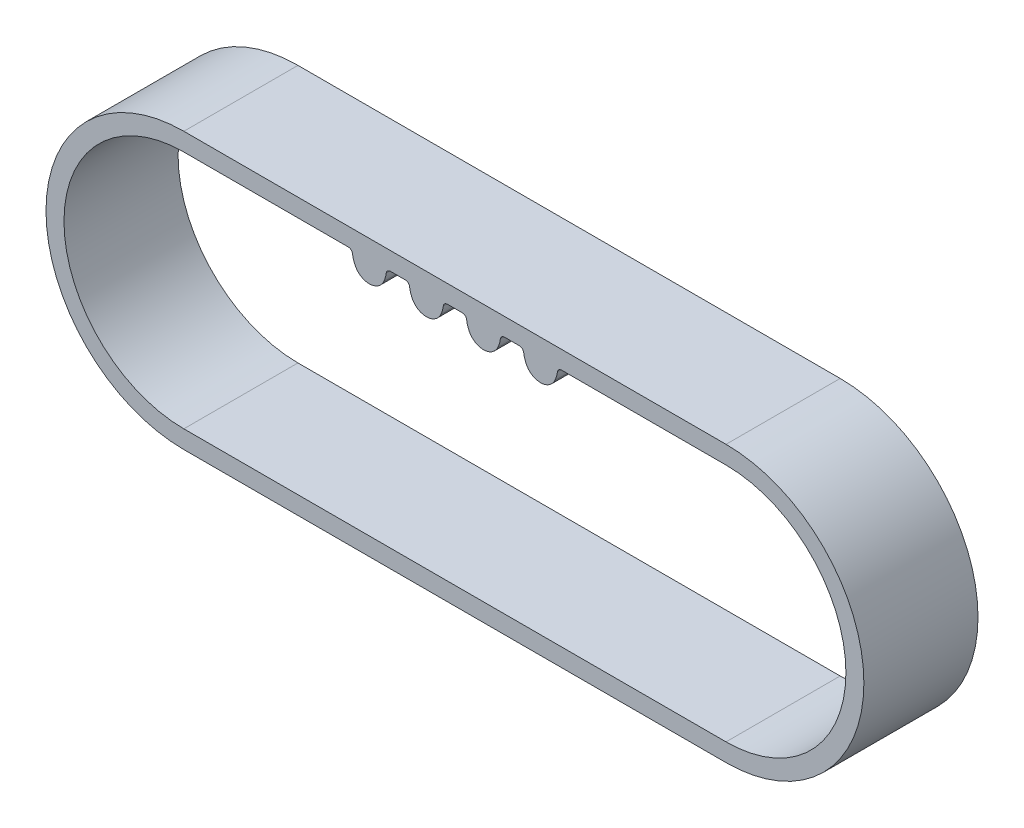
ISO-10303-21;
HEADER;
FILE_DESCRIPTION(('STEP AP214'),'2;1');
FILE_NAME('part.step','',(''),(''),'','','');
FILE_SCHEMA(('AUTOMOTIVE_DESIGN { 1 0 10303 214 1 1 1 1 }'));
ENDSEC;
DATA;
#1=APPLICATION_CONTEXT('core data for automotive mechanical design processes');
#2=APPLICATION_PROTOCOL_DEFINITION('international standard','automotive_design',2000,#1);
#3=PRODUCT_CONTEXT('',#1,'mechanical');
#4=PRODUCT('Part','Part','',(#3));
#5=PRODUCT_RELATED_PRODUCT_CATEGORY('part','',(#4));
#6=PRODUCT_DEFINITION_FORMATION('','',#4);
#7=PRODUCT_DEFINITION_CONTEXT('part definition',#1,'design');
#8=PRODUCT_DEFINITION('design','',#6,#7);
#9=PRODUCT_DEFINITION_SHAPE('','',#8);
#10=(LENGTH_UNIT() NAMED_UNIT(*) SI_UNIT(.MILLI.,.METRE.));
#11=(NAMED_UNIT(*) PLANE_ANGLE_UNIT() SI_UNIT($,.RADIAN.));
#12=(NAMED_UNIT(*) SI_UNIT($,.STERADIAN.) SOLID_ANGLE_UNIT());
#13=UNCERTAINTY_MEASURE_WITH_UNIT(LENGTH_MEASURE(1.E-05),#10,'distance_accuracy_value','');
#14=(GEOMETRIC_REPRESENTATION_CONTEXT(3) GLOBAL_UNCERTAINTY_ASSIGNED_CONTEXT((#13)) GLOBAL_UNIT_ASSIGNED_CONTEXT((#10,
#11,#12)) REPRESENTATION_CONTEXT('',''));
#15=CARTESIAN_POINT('',(0.,0.,0.));
#16=DIRECTION('',(0.,0.,1.));
#17=DIRECTION('',(1.,0.,0.));
#18=AXIS2_PLACEMENT_3D('',#15,#16,#17);
#19=CARTESIAN_POINT('',(0.,4.201,2.));
#20=DIRECTION('',(0.,-1.,0.));
#21=DIRECTION('',(0.,0.,-1.));
#22=AXIS2_PLACEMENT_3D('',#19,#20,#21);
#23=PLANE('',#22);
#24=DIRECTION('',(-1.,0.,0.));
#25=VECTOR('',#24,1.);
#26=CARTESIAN_POINT('',(0.,4.201,2.));
#27=LINE('',#26,#25);
#28=CARTESIAN_POINT('',(11.7619269390295,4.201,2.));
#29=VERTEX_POINT('',#28);
#30=CARTESIAN_POINT('',(11.2422777892278,4.201,2.));
#31=VERTEX_POINT('',#30);
#32=EDGE_CURVE('E423',#29,#31,#27,.T.);
#33=ORIENTED_EDGE('',*,*,#32,.T.);
#34=DIRECTION('',(0.,0.,-1.));
#35=VECTOR('',#34,1.);
#36=CARTESIAN_POINT('',(11.2422777892278,4.201,2.));
#37=LINE('',#36,#35);
#38=CARTESIAN_POINT('',(11.2422777892278,4.201,-2.));
#39=VERTEX_POINT('',#38);
#40=EDGE_CURVE('E324',#31,#39,#37,.T.);
#41=ORIENTED_EDGE('',*,*,#40,.T.);
#42=DIRECTION('',(-1.,0.,0.));
#43=VECTOR('',#42,1.);
#44=CARTESIAN_POINT('',(0.,4.201,-2.));
#45=LINE('',#44,#43);
#46=CARTESIAN_POINT('',(11.7619269390295,4.201,-2.));
#47=VERTEX_POINT('',#46);
#48=EDGE_CURVE('E436',#47,#39,#45,.T.);
#49=ORIENTED_EDGE('',*,*,#48,.F.);
#50=DIRECTION('',(0.,0.,-1.));
#51=VECTOR('',#50,1.);
#52=CARTESIAN_POINT('',(11.7619269390295,4.201,2.));
#53=LINE('',#52,#51);
#54=EDGE_CURVE('E322',#29,#47,#53,.T.);
#55=ORIENTED_EDGE('',*,*,#54,.F.);
#56=EDGE_LOOP('',(#33,#41,#49,#55));
#57=FACE_BOUND('',#56,.T.);
#58=ADVANCED_FACE('F37',(#57),#23,.T.);
#59=CARTESIAN_POINT('',(19.0042047282575,4.201,2.));
#60=VERTEX_POINT('',#59);
#61=CARTESIAN_POINT('',(13.2422777892278,4.201,2.));
#62=VERTEX_POINT('',#61);
#63=EDGE_CURVE('E420',#60,#62,#27,.T.);
#64=ORIENTED_EDGE('',*,*,#63,.T.);
#65=DIRECTION('',(0.,0.,-1.));
#66=VECTOR('',#65,1.);
#67=CARTESIAN_POINT('',(13.2422777892278,4.201,2.));
#68=LINE('',#67,#66);
#69=CARTESIAN_POINT('',(13.2422777892278,4.201,-2.));
#70=VERTEX_POINT('',#69);
#71=EDGE_CURVE('E311',#62,#70,#68,.T.);
#72=ORIENTED_EDGE('',*,*,#71,.T.);
#73=CARTESIAN_POINT('',(19.0042047282575,4.201,-2.));
#74=VERTEX_POINT('',#73);
#75=EDGE_CURVE('E414',#74,#70,#45,.T.);
#76=ORIENTED_EDGE('',*,*,#75,.F.);
#77=DIRECTION('',(0.,0.,-1.));
#78=VECTOR('',#77,1.);
#79=CARTESIAN_POINT('',(19.0042047282575,4.201,2.));
#80=LINE('',#79,#78);
#81=EDGE_CURVE('E441',#60,#74,#80,.T.);
#82=ORIENTED_EDGE('',*,*,#81,.F.);
#83=EDGE_LOOP('',(#64,#72,#76,#82));
#84=FACE_BOUND('',#83,.T.);
#85=ADVANCED_FACE('F498',(#84),#23,.T.);
#86=CARTESIAN_POINT('',(7.76192693902953,4.201,2.));
#87=VERTEX_POINT('',#86);
#88=CARTESIAN_POINT('',(7.24227778922783,4.201,2.));
#89=VERTEX_POINT('',#88);
#90=EDGE_CURVE('E425',#87,#89,#27,.T.);
#91=ORIENTED_EDGE('',*,*,#90,.T.);
#92=DIRECTION('',(0.,0.,-1.));
#93=VECTOR('',#92,1.);
#94=CARTESIAN_POINT('',(7.24227778922783,4.201,2.));
#95=LINE('',#94,#93);
#96=CARTESIAN_POINT('',(7.24227778922783,4.201,-2.));
#97=VERTEX_POINT('',#96);
#98=EDGE_CURVE('E399',#89,#97,#95,.T.);
#99=ORIENTED_EDGE('',*,*,#98,.T.);
#100=CARTESIAN_POINT('',(7.76192693902953,4.201,-2.));
#101=VERTEX_POINT('',#100);
#102=EDGE_CURVE('E438',#101,#97,#45,.T.);
#103=ORIENTED_EDGE('',*,*,#102,.F.);
#104=DIRECTION('',(0.,0.,-1.));
#105=VECTOR('',#104,1.);
#106=CARTESIAN_POINT('',(7.76192693902953,4.201,2.));
#107=LINE('',#106,#105);
#108=EDGE_CURVE('E396',#87,#101,#107,.T.);
#109=ORIENTED_EDGE('',*,*,#108,.F.);
#110=EDGE_LOOP('',(#91,#99,#103,#109));
#111=FACE_BOUND('',#110,.T.);
#112=ADVANCED_FACE('F505',(#111),#23,.T.);
#113=DIRECTION('',(0.,0.,-1.));
#114=VECTOR('',#113,1.);
#115=CARTESIAN_POINT('',(9.76192693902955,4.201,2.));
#116=LINE('',#115,#114);
#117=CARTESIAN_POINT('',(9.76192693902955,4.201,2.));
#118=VERTEX_POINT('',#117);
#119=CARTESIAN_POINT('',(9.76192693902955,4.201,-2.));
#120=VERTEX_POINT('',#119);
#121=EDGE_CURVE('E267',#118,#120,#116,.T.);
#122=ORIENTED_EDGE('',*,*,#121,.F.);
#123=CARTESIAN_POINT('',(9.24227778922785,4.201,2.));
#124=VERTEX_POINT('',#123);
#125=EDGE_CURVE('E424',#118,#124,#27,.T.);
#126=ORIENTED_EDGE('',*,*,#125,.T.);
#127=DIRECTION('',(0.,0.,-1.));
#128=VECTOR('',#127,1.);
#129=CARTESIAN_POINT('',(9.24227778922785,4.201,2.));
#130=LINE('',#129,#128);
#131=CARTESIAN_POINT('',(9.24227778922785,4.201,-2.));
#132=VERTEX_POINT('',#131);
#133=EDGE_CURVE('E385',#124,#132,#130,.T.);
#134=ORIENTED_EDGE('',*,*,#133,.T.);
#135=EDGE_CURVE('E437',#120,#132,#45,.T.);
#136=ORIENTED_EDGE('',*,*,#135,.F.);
#137=EDGE_LOOP('',(#122,#126,#134,#136));
#138=FACE_BOUND('',#137,.T.);
#139=ADVANCED_FACE('F514',(#138),#23,.T.);
#140=CARTESIAN_POINT('',(0.,0.,2.));
#141=DIRECTION('',(0.,0.,1.));
#142=DIRECTION('',(1.,0.,0.));
#143=AXIS2_PLACEMENT_3D('',#140,#141,#142);
#144=PLANE('',#143);
#145=CARTESIAN_POINT('',(13.2422777892278,4.051,2.));
#146=DIRECTION('',(0.,0.,-1.));
#147=DIRECTION('',(-1.,0.,0.));
#148=AXIS2_PLACEMENT_3D('',#145,#146,#147);
#149=CIRCLE('',#148,0.150000000000001);
#150=CARTESIAN_POINT('',(13.0935592555193,4.0705652173913,2.));
#151=VERTEX_POINT('',#150);
#152=EDGE_CURVE('E307',#151,#62,#149,.T.);
#153=ORIENTED_EDGE('',*,*,#152,.T.);
#154=ORIENTED_EDGE('',*,*,#63,.F.);
#155=CARTESIAN_POINT('',(19.0042047282575,0.,2.));
#156=DIRECTION('',(0.,0.,1.));
#157=DIRECTION('',(-1.,0.,0.));
#158=AXIS2_PLACEMENT_3D('',#155,#156,#157);
#159=CIRCLE('',#158,4.201);
#160=CARTESIAN_POINT('',(19.0042047282575,-4.201,2.));
#161=VERTEX_POINT('',#160);
#162=EDGE_CURVE('E416',#161,#60,#159,.T.);
#163=ORIENTED_EDGE('',*,*,#162,.F.);
#164=DIRECTION('',(1.,0.,0.));
#165=VECTOR('',#164,1.);
#166=CARTESIAN_POINT('',(0.,-4.201,2.));
#167=LINE('',#166,#165);
#168=CARTESIAN_POINT('',(0.,-4.201,2.));
#169=VERTEX_POINT('',#168);
#170=EDGE_CURVE('E413',#169,#161,#167,.T.);
#171=ORIENTED_EDGE('',*,*,#170,.F.);
#172=CARTESIAN_POINT('',(0.,0.,2.));
#173=DIRECTION('',(0.,0.,1.));
#174=DIRECTION('',(-1.,0.,0.));
#175=AXIS2_PLACEMENT_3D('',#172,#173,#174);
#176=CIRCLE('',#175,4.201);
#177=CARTESIAN_POINT('',(0.,4.201,2.));
#178=VERTEX_POINT('',#177);
#179=EDGE_CURVE('E411',#178,#169,#176,.T.);
#180=ORIENTED_EDGE('',*,*,#179,.F.);
#181=CARTESIAN_POINT('',(5.76192693902955,4.201,2.));
#182=VERTEX_POINT('',#181);
#183=EDGE_CURVE('E419',#182,#178,#27,.T.);
#184=ORIENTED_EDGE('',*,*,#183,.F.);
#185=CARTESIAN_POINT('',(5.76192693902955,4.051,2.));
#186=DIRECTION('',(0.,0.,-1.));
#187=DIRECTION('',(-1.,0.,0.));
#188=AXIS2_PLACEMENT_3D('',#185,#186,#187);
#189=CIRCLE('',#188,0.15);
#190=CARTESIAN_POINT('',(5.91064547273813,4.0705652173913,2.));
#191=VERTEX_POINT('',#190);
#192=EDGE_CURVE('E360',#182,#191,#189,.T.);
#193=ORIENTED_EDGE('',*,*,#192,.T.);
#194=CARTESIAN_POINT('',(6.90210236412869,4.201,2.));
#195=DIRECTION('',(0.,0.,1.));
#196=DIRECTION('',(1.,0.,0.));
#197=AXIS2_PLACEMENT_3D('',#194,#195,#196);
#198=CIRCLE('',#197,1.);
#199=CARTESIAN_POINT('',(6.0032259596343,3.76279775280899,2.));
#200=VERTEX_POINT('',#199);
#201=EDGE_CURVE('E363',#191,#200,#198,.T.);
#202=ORIENTED_EDGE('',*,*,#201,.T.);
#203=CARTESIAN_POINT('',(6.50210236412869,4.006,2.));
#204=DIRECTION('',(0.,0.,1.));
#205=DIRECTION('',(1.,0.,0.));
#206=AXIS2_PLACEMENT_3D('',#203,#204,#205);
#207=CIRCLE('',#206,0.555000000000001);
#208=CARTESIAN_POINT('',(7.00097876862307,3.76279775280899,2.));
#209=VERTEX_POINT('',#208);
#210=EDGE_CURVE('E365',#200,#209,#207,.T.);
#211=ORIENTED_EDGE('',*,*,#210,.T.);
#212=CARTESIAN_POINT('',(6.10210236412869,4.201,2.));
#213=DIRECTION('',(0.,0.,1.));
#214=DIRECTION('',(1.,0.,0.));
#215=AXIS2_PLACEMENT_3D('',#212,#213,#214);
#216=CIRCLE('',#215,1.);
#217=CARTESIAN_POINT('',(7.09355925551924,4.0705652173913,2.));
#218=VERTEX_POINT('',#217);
#219=EDGE_CURVE('E367',#209,#218,#216,.T.);
#220=ORIENTED_EDGE('',*,*,#219,.T.);
#221=CARTESIAN_POINT('',(7.24227778922783,4.051,2.));
#222=DIRECTION('',(0.,0.,-1.));
#223=DIRECTION('',(-1.,0.,0.));
#224=AXIS2_PLACEMENT_3D('',#221,#222,#223);
#225=CIRCLE('',#224,0.15);
#226=EDGE_CURVE('E369',#218,#89,#225,.T.);
#227=ORIENTED_EDGE('',*,*,#226,.T.);
#228=ORIENTED_EDGE('',*,*,#90,.F.);
#229=CARTESIAN_POINT('',(7.76192693902953,4.051,2.));
#230=DIRECTION('',(0.,0.,-1.));
#231=DIRECTION('',(-1.,0.,0.));
#232=AXIS2_PLACEMENT_3D('',#229,#230,#231);
#233=CIRCLE('',#232,0.149999999999999);
#234=CARTESIAN_POINT('',(7.91064547273809,4.0705652173913,2.));
#235=VERTEX_POINT('',#234);
#236=EDGE_CURVE('E371',#87,#235,#233,.T.);
#237=ORIENTED_EDGE('',*,*,#236,.T.);
#238=CARTESIAN_POINT('',(8.90210236412867,4.201,2.));
#239=DIRECTION('',(0.,0.,1.));
#240=DIRECTION('',(1.,0.,0.));
#241=AXIS2_PLACEMENT_3D('',#238,#239,#240);
#242=CIRCLE('',#241,1.00000000000002);
#243=CARTESIAN_POINT('',(8.00322595963428,3.76279775280895,2.));
#244=VERTEX_POINT('',#243);
#245=EDGE_CURVE('E373',#235,#244,#242,.T.);
#246=ORIENTED_EDGE('',*,*,#245,.T.);
#247=CARTESIAN_POINT('',(8.5021023641287,4.006,2.));
#248=DIRECTION('',(0.,0.,1.));
#249=DIRECTION('',(1.,0.,0.));
#250=AXIS2_PLACEMENT_3D('',#247,#248,#249);
#251=CIRCLE('',#250,0.555000000000056);
#252=CARTESIAN_POINT('',(9.00097876862309,3.76279775280895,2.));
#253=VERTEX_POINT('',#252);
#254=EDGE_CURVE('E375',#244,#253,#251,.T.);
#255=ORIENTED_EDGE('',*,*,#254,.T.);
#256=CARTESIAN_POINT('',(8.10210236412871,4.201,2.));
#257=DIRECTION('',(0.,0.,1.));
#258=DIRECTION('',(1.,0.,0.));
#259=AXIS2_PLACEMENT_3D('',#256,#257,#258);
#260=CIRCLE('',#259,1.00000000000002);
#261=CARTESIAN_POINT('',(9.09355925551926,4.0705652173913,2.));
#262=VERTEX_POINT('',#261);
#263=EDGE_CURVE('E377',#253,#262,#260,.T.);
#264=ORIENTED_EDGE('',*,*,#263,.T.);
#265=CARTESIAN_POINT('',(9.24227778922785,4.051,2.));
#266=DIRECTION('',(0.,0.,-1.));
#267=DIRECTION('',(-1.,0.,0.));
#268=AXIS2_PLACEMENT_3D('',#265,#266,#267);
#269=CIRCLE('',#268,0.150000000000001);
#270=EDGE_CURVE('E379',#262,#124,#269,.T.);
#271=ORIENTED_EDGE('',*,*,#270,.T.);
#272=ORIENTED_EDGE('',*,*,#125,.F.);
#273=CARTESIAN_POINT('',(9.76192693902955,4.051,2.));
#274=DIRECTION('',(0.,0.,-1.));
#275=DIRECTION('',(-1.,0.,0.));
#276=AXIS2_PLACEMENT_3D('',#273,#274,#275);
#277=CIRCLE('',#276,0.15);
#278=CARTESIAN_POINT('',(9.91064547273813,4.0705652173913,2.));
#279=VERTEX_POINT('',#278);
#280=EDGE_CURVE('E290',#118,#279,#277,.T.);
#281=ORIENTED_EDGE('',*,*,#280,.T.);
#282=CARTESIAN_POINT('',(10.9021023641287,4.201,2.));
#283=DIRECTION('',(0.,0.,1.));
#284=DIRECTION('',(1.,0.,0.));
#285=AXIS2_PLACEMENT_3D('',#282,#283,#284);
#286=CIRCLE('',#285,1.);
#287=CARTESIAN_POINT('',(10.0032259596343,3.76279775280899,2.));
#288=VERTEX_POINT('',#287);
#289=EDGE_CURVE('E252',#279,#288,#286,.T.);
#290=ORIENTED_EDGE('',*,*,#289,.T.);
#291=CARTESIAN_POINT('',(10.5021023641287,4.006,2.));
#292=DIRECTION('',(0.,0.,1.));
#293=DIRECTION('',(1.,0.,0.));
#294=AXIS2_PLACEMENT_3D('',#291,#292,#293);
#295=CIRCLE('',#294,0.555000000000001);
#296=CARTESIAN_POINT('',(11.0009787686231,3.76279775280899,2.));
#297=VERTEX_POINT('',#296);
#298=EDGE_CURVE('E293',#288,#297,#295,.T.);
#299=ORIENTED_EDGE('',*,*,#298,.T.);
#300=CARTESIAN_POINT('',(10.1021023641287,4.201,2.));
#301=DIRECTION('',(0.,0.,1.));
#302=DIRECTION('',(1.,0.,0.));
#303=AXIS2_PLACEMENT_3D('',#300,#301,#302);
#304=CIRCLE('',#303,1.);
#305=CARTESIAN_POINT('',(11.0935592555192,4.0705652173913,2.));
#306=VERTEX_POINT('',#305);
#307=EDGE_CURVE('E295',#297,#306,#304,.T.);
#308=ORIENTED_EDGE('',*,*,#307,.T.);
#309=CARTESIAN_POINT('',(11.2422777892278,4.051,2.));
#310=DIRECTION('',(0.,0.,-1.));
#311=DIRECTION('',(-1.,0.,0.));
#312=AXIS2_PLACEMENT_3D('',#309,#310,#311);
#313=CIRCLE('',#312,0.15);
#314=EDGE_CURVE('E297',#306,#31,#313,.T.);
#315=ORIENTED_EDGE('',*,*,#314,.T.);
#316=ORIENTED_EDGE('',*,*,#32,.F.);
#317=CARTESIAN_POINT('',(11.7619269390295,4.051,2.));
#318=DIRECTION('',(0.,0.,-1.));
#319=DIRECTION('',(-1.,0.,0.));
#320=AXIS2_PLACEMENT_3D('',#317,#318,#319);
#321=CIRCLE('',#320,0.149999999999999);
#322=CARTESIAN_POINT('',(11.9106454727381,4.0705652173913,2.));
#323=VERTEX_POINT('',#322);
#324=EDGE_CURVE('E299',#29,#323,#321,.T.);
#325=ORIENTED_EDGE('',*,*,#324,.T.);
#326=CARTESIAN_POINT('',(12.9021023641287,4.201,2.));
#327=DIRECTION('',(0.,0.,1.));
#328=DIRECTION('',(1.,0.,0.));
#329=AXIS2_PLACEMENT_3D('',#326,#327,#328);
#330=CIRCLE('',#329,1.00000000000002);
#331=CARTESIAN_POINT('',(12.0032259596343,3.76279775280895,2.));
#332=VERTEX_POINT('',#331);
#333=EDGE_CURVE('E301',#323,#332,#330,.T.);
#334=ORIENTED_EDGE('',*,*,#333,.T.);
#335=CARTESIAN_POINT('',(12.5021023641287,4.006,2.));
#336=DIRECTION('',(0.,0.,1.));
#337=DIRECTION('',(1.,0.,0.));
#338=AXIS2_PLACEMENT_3D('',#335,#336,#337);
#339=CIRCLE('',#338,0.555000000000056);
#340=CARTESIAN_POINT('',(13.0009787686231,3.76279775280895,2.));
#341=VERTEX_POINT('',#340);
#342=EDGE_CURVE('E303',#332,#341,#339,.T.);
#343=ORIENTED_EDGE('',*,*,#342,.T.);
#344=CARTESIAN_POINT('',(12.1021023641287,4.201,2.));
#345=DIRECTION('',(0.,0.,1.));
#346=DIRECTION('',(1.,0.,0.));
#347=AXIS2_PLACEMENT_3D('',#344,#345,#346);
#348=CIRCLE('',#347,1.00000000000002);
#349=EDGE_CURVE('E305',#341,#151,#348,.T.);
#350=ORIENTED_EDGE('',*,*,#349,.T.);
#351=EDGE_LOOP('',(#153,#154,#163,#171,#180,#184,#193,#202,#211,#220,#227,#228,#237,#246,#255,
#264,#271,#272,#281,#290,#299,#308,#315,#316,#325,#334,#343,#350));
#352=FACE_BOUND('',#351,.T.);
#353=DIRECTION('',(-1.,0.,0.));
#354=VECTOR('',#353,1.);
#355=CARTESIAN_POINT('',(0.,4.831,2.));
#356=LINE('',#355,#354);
#357=CARTESIAN_POINT('',(19.0042047282575,4.831,2.));
#358=VERTEX_POINT('',#357);
#359=CARTESIAN_POINT('',(0.,4.831,2.));
#360=VERTEX_POINT('',#359);
#361=EDGE_CURVE('E457',#358,#360,#356,.T.);
#362=ORIENTED_EDGE('',*,*,#361,.T.);
#363=CARTESIAN_POINT('',(0.,0.,2.));
#364=DIRECTION('',(0.,0.,1.));
#365=DIRECTION('',(1.,0.,0.));
#366=AXIS2_PLACEMENT_3D('',#363,#364,#365);
#367=CIRCLE('',#366,4.831);
#368=CARTESIAN_POINT('',(0.,-4.831,2.));
#369=VERTEX_POINT('',#368);
#370=EDGE_CURVE('E449',#360,#369,#367,.T.);
#371=ORIENTED_EDGE('',*,*,#370,.T.);
#372=DIRECTION('',(1.,0.,0.));
#373=VECTOR('',#372,1.);
#374=CARTESIAN_POINT('',(0.,-4.831,2.));
#375=LINE('',#374,#373);
#376=CARTESIAN_POINT('',(19.0042047282575,-4.831,2.));
#377=VERTEX_POINT('',#376);
#378=EDGE_CURVE('E452',#369,#377,#375,.T.);
#379=ORIENTED_EDGE('',*,*,#378,.T.);
#380=CARTESIAN_POINT('',(19.0042047282575,0.,2.));
#381=DIRECTION('',(0.,0.,1.));
#382=DIRECTION('',(1.,0.,0.));
#383=AXIS2_PLACEMENT_3D('',#380,#381,#382);
#384=CIRCLE('',#383,4.831);
#385=EDGE_CURVE('E455',#377,#358,#384,.T.);
#386=ORIENTED_EDGE('',*,*,#385,.T.);
#387=EDGE_LOOP('',(#362,#371,#379,#386));
#388=FACE_BOUND('',#387,.T.);
#389=ADVANCED_FACE('F489',(#352,#388),#144,.T.);
#390=CARTESIAN_POINT('',(0.,0.,-2.));
#391=DIRECTION('',(0.,0.,1.));
#392=DIRECTION('',(1.,0.,0.));
#393=AXIS2_PLACEMENT_3D('',#390,#391,#392);
#394=PLANE('',#393);
#395=ORIENTED_EDGE('',*,*,#75,.T.);
#396=CARTESIAN_POINT('',(13.2422777892278,4.051,-2.));
#397=DIRECTION('',(0.,0.,-1.));
#398=DIRECTION('',(-1.,0.,0.));
#399=AXIS2_PLACEMENT_3D('',#396,#397,#398);
#400=CIRCLE('',#399,0.150000000000001);
#401=CARTESIAN_POINT('',(13.0935592555193,4.0705652173913,-2.));
#402=VERTEX_POINT('',#401);
#403=EDGE_CURVE('E287',#402,#70,#400,.T.);
#404=ORIENTED_EDGE('',*,*,#403,.F.);
#405=CARTESIAN_POINT('',(12.1021023641287,4.201,-2.));
#406=DIRECTION('',(0.,0.,1.));
#407=DIRECTION('',(1.,0.,0.));
#408=AXIS2_PLACEMENT_3D('',#405,#406,#407);
#409=CIRCLE('',#408,1.00000000000002);
#410=CARTESIAN_POINT('',(13.0009787686231,3.76279775280895,-2.));
#411=VERTEX_POINT('',#410);
#412=EDGE_CURVE('E284',#411,#402,#409,.T.);
#413=ORIENTED_EDGE('',*,*,#412,.F.);
#414=CARTESIAN_POINT('',(12.5021023641287,4.006,-2.));
#415=DIRECTION('',(0.,0.,1.));
#416=DIRECTION('',(1.,0.,0.));
#417=AXIS2_PLACEMENT_3D('',#414,#415,#416);
#418=CIRCLE('',#417,0.555000000000056);
#419=CARTESIAN_POINT('',(12.0032259596343,3.76279775280895,-2.));
#420=VERTEX_POINT('',#419);
#421=EDGE_CURVE('E281',#420,#411,#418,.T.);
#422=ORIENTED_EDGE('',*,*,#421,.F.);
#423=CARTESIAN_POINT('',(12.9021023641287,4.201,-2.));
#424=DIRECTION('',(0.,0.,1.));
#425=DIRECTION('',(1.,0.,0.));
#426=AXIS2_PLACEMENT_3D('',#423,#424,#425);
#427=CIRCLE('',#426,1.00000000000002);
#428=CARTESIAN_POINT('',(11.9106454727381,4.0705652173913,-2.));
#429=VERTEX_POINT('',#428);
#430=EDGE_CURVE('E278',#429,#420,#427,.T.);
#431=ORIENTED_EDGE('',*,*,#430,.F.);
#432=CARTESIAN_POINT('',(11.7619269390295,4.051,-2.));
#433=DIRECTION('',(0.,0.,-1.));
#434=DIRECTION('',(-1.,0.,0.));
#435=AXIS2_PLACEMENT_3D('',#432,#433,#434);
#436=CIRCLE('',#435,0.149999999999999);
#437=EDGE_CURVE('E59',#47,#429,#436,.T.);
#438=ORIENTED_EDGE('',*,*,#437,.F.);
#439=ORIENTED_EDGE('',*,*,#48,.T.);
#440=CARTESIAN_POINT('',(11.2422777892278,4.051,-2.));
#441=DIRECTION('',(0.,0.,-1.));
#442=DIRECTION('',(-1.,0.,0.));
#443=AXIS2_PLACEMENT_3D('',#440,#441,#442);
#444=CIRCLE('',#443,0.15);
#445=CARTESIAN_POINT('',(11.0935592555192,4.0705652173913,-2.));
#446=VERTEX_POINT('',#445);
#447=EDGE_CURVE('E275',#446,#39,#444,.T.);
#448=ORIENTED_EDGE('',*,*,#447,.F.);
#449=CARTESIAN_POINT('',(10.1021023641287,4.201,-2.));
#450=DIRECTION('',(0.,0.,1.));
#451=DIRECTION('',(1.,0.,0.));
#452=AXIS2_PLACEMENT_3D('',#449,#450,#451);
#453=CIRCLE('',#452,1.);
#454=CARTESIAN_POINT('',(11.0009787686231,3.76279775280899,-2.));
#455=VERTEX_POINT('',#454);
#456=EDGE_CURVE('E272',#455,#446,#453,.T.);
#457=ORIENTED_EDGE('',*,*,#456,.F.);
#458=CARTESIAN_POINT('',(10.5021023641287,4.006,-2.));
#459=DIRECTION('',(0.,0.,1.));
#460=DIRECTION('',(1.,0.,0.));
#461=AXIS2_PLACEMENT_3D('',#458,#459,#460);
#462=CIRCLE('',#461,0.555000000000001);
#463=CARTESIAN_POINT('',(10.0032259596343,3.76279775280899,-2.));
#464=VERTEX_POINT('',#463);
#465=EDGE_CURVE('E263',#464,#455,#462,.T.);
#466=ORIENTED_EDGE('',*,*,#465,.F.);
#467=CARTESIAN_POINT('',(10.9021023641287,4.201,-2.));
#468=DIRECTION('',(0.,0.,1.));
#469=DIRECTION('',(1.,0.,0.));
#470=AXIS2_PLACEMENT_3D('',#467,#468,#469);
#471=CIRCLE('',#470,1.);
#472=CARTESIAN_POINT('',(9.91064547273813,4.0705652173913,-2.));
#473=VERTEX_POINT('',#472);
#474=EDGE_CURVE('E251',#473,#464,#471,.T.);
#475=ORIENTED_EDGE('',*,*,#474,.F.);
#476=CARTESIAN_POINT('',(9.76192693902955,4.051,-2.));
#477=DIRECTION('',(0.,0.,-1.));
#478=DIRECTION('',(-1.,0.,0.));
#479=AXIS2_PLACEMENT_3D('',#476,#477,#478);
#480=CIRCLE('',#479,0.15);
#481=EDGE_CURVE('E52',#120,#473,#480,.T.);
#482=ORIENTED_EDGE('',*,*,#481,.F.);
#483=ORIENTED_EDGE('',*,*,#135,.T.);
#484=CARTESIAN_POINT('',(9.24227778922785,4.051,-2.));
#485=DIRECTION('',(0.,0.,-1.));
#486=DIRECTION('',(-1.,0.,0.));
#487=AXIS2_PLACEMENT_3D('',#484,#485,#486);
#488=CIRCLE('',#487,0.150000000000001);
#489=CARTESIAN_POINT('',(9.09355925551926,4.0705652173913,-2.));
#490=VERTEX_POINT('',#489);
#491=EDGE_CURVE('E357',#490,#132,#488,.T.);
#492=ORIENTED_EDGE('',*,*,#491,.F.);
#493=CARTESIAN_POINT('',(8.10210236412871,4.201,-2.));
#494=DIRECTION('',(0.,0.,1.));
#495=DIRECTION('',(1.,0.,0.));
#496=AXIS2_PLACEMENT_3D('',#493,#494,#495);
#497=CIRCLE('',#496,1.00000000000002);
#498=CARTESIAN_POINT('',(9.00097876862309,3.76279775280895,-2.));
#499=VERTEX_POINT('',#498);
#500=EDGE_CURVE('E354',#499,#490,#497,.T.);
#501=ORIENTED_EDGE('',*,*,#500,.F.);
#502=CARTESIAN_POINT('',(8.5021023641287,4.006,-2.));
#503=DIRECTION('',(0.,0.,1.));
#504=DIRECTION('',(1.,0.,0.));
#505=AXIS2_PLACEMENT_3D('',#502,#503,#504);
#506=CIRCLE('',#505,0.555000000000056);
#507=CARTESIAN_POINT('',(8.00322595963428,3.76279775280895,-2.));
#508=VERTEX_POINT('',#507);
#509=EDGE_CURVE('E351',#508,#499,#506,.T.);
#510=ORIENTED_EDGE('',*,*,#509,.F.);
#511=CARTESIAN_POINT('',(8.90210236412867,4.201,-2.));
#512=DIRECTION('',(0.,0.,1.));
#513=DIRECTION('',(1.,0.,0.));
#514=AXIS2_PLACEMENT_3D('',#511,#512,#513);
#515=CIRCLE('',#514,1.00000000000002);
#516=CARTESIAN_POINT('',(7.91064547273809,4.0705652173913,-2.));
#517=VERTEX_POINT('',#516);
#518=EDGE_CURVE('E348',#517,#508,#515,.T.);
#519=ORIENTED_EDGE('',*,*,#518,.F.);
#520=CARTESIAN_POINT('',(7.76192693902953,4.051,-2.));
#521=DIRECTION('',(0.,0.,-1.));
#522=DIRECTION('',(-1.,0.,0.));
#523=AXIS2_PLACEMENT_3D('',#520,#521,#522);
#524=CIRCLE('',#523,0.149999999999999);
#525=EDGE_CURVE('E345',#101,#517,#524,.T.);
#526=ORIENTED_EDGE('',*,*,#525,.F.);
#527=ORIENTED_EDGE('',*,*,#102,.T.);
#528=CARTESIAN_POINT('',(7.24227778922783,4.051,-2.));
#529=DIRECTION('',(0.,0.,-1.));
#530=DIRECTION('',(-1.,0.,0.));
#531=AXIS2_PLACEMENT_3D('',#528,#529,#530);
#532=CIRCLE('',#531,0.15);
#533=CARTESIAN_POINT('',(7.09355925551924,4.0705652173913,-2.));
#534=VERTEX_POINT('',#533);
#535=EDGE_CURVE('E343',#534,#97,#532,.T.);
#536=ORIENTED_EDGE('',*,*,#535,.F.);
#537=CARTESIAN_POINT('',(6.10210236412869,4.201,-2.));
#538=DIRECTION('',(0.,0.,1.));
#539=DIRECTION('',(1.,0.,0.));
#540=AXIS2_PLACEMENT_3D('',#537,#538,#539);
#541=CIRCLE('',#540,1.);
#542=CARTESIAN_POINT('',(7.00097876862307,3.76279775280899,-2.));
#543=VERTEX_POINT('',#542);
#544=EDGE_CURVE('E340',#543,#534,#541,.T.);
#545=ORIENTED_EDGE('',*,*,#544,.F.);
#546=CARTESIAN_POINT('',(6.50210236412869,4.006,-2.));
#547=DIRECTION('',(0.,0.,1.));
#548=DIRECTION('',(1.,0.,0.));
#549=AXIS2_PLACEMENT_3D('',#546,#547,#548);
#550=CIRCLE('',#549,0.555000000000001);
#551=CARTESIAN_POINT('',(6.0032259596343,3.76279775280899,-2.));
#552=VERTEX_POINT('',#551);
#553=EDGE_CURVE('E337',#552,#543,#550,.T.);
#554=ORIENTED_EDGE('',*,*,#553,.F.);
#555=CARTESIAN_POINT('',(6.90210236412869,4.201,-2.));
#556=DIRECTION('',(0.,0.,1.));
#557=DIRECTION('',(1.,0.,0.));
#558=AXIS2_PLACEMENT_3D('',#555,#556,#557);
#559=CIRCLE('',#558,1.);
#560=CARTESIAN_POINT('',(5.91064547273813,4.0705652173913,-2.));
#561=VERTEX_POINT('',#560);
#562=EDGE_CURVE('E334',#561,#552,#559,.T.);
#563=ORIENTED_EDGE('',*,*,#562,.F.);
#564=CARTESIAN_POINT('',(5.76192693902955,4.051,-2.));
#565=DIRECTION('',(0.,0.,-1.));
#566=DIRECTION('',(-1.,0.,0.));
#567=AXIS2_PLACEMENT_3D('',#564,#565,#566);
#568=CIRCLE('',#567,0.15);
#569=CARTESIAN_POINT('',(5.76192693902955,4.201,-2.));
#570=VERTEX_POINT('',#569);
#571=EDGE_CURVE('E255',#570,#561,#568,.T.);
#572=ORIENTED_EDGE('',*,*,#571,.F.);
#573=CARTESIAN_POINT('',(0.,4.201,-2.));
#574=VERTEX_POINT('',#573);
#575=EDGE_CURVE('E434',#570,#574,#45,.T.);
#576=ORIENTED_EDGE('',*,*,#575,.T.);
#577=CARTESIAN_POINT('',(0.,0.,-2.));
#578=DIRECTION('',(0.,0.,1.));
#579=DIRECTION('',(-1.,0.,0.));
#580=AXIS2_PLACEMENT_3D('',#577,#578,#579);
#581=CIRCLE('',#580,4.201);
#582=CARTESIAN_POINT('',(0.,-4.201,-2.));
#583=VERTEX_POINT('',#582);
#584=EDGE_CURVE('E410',#574,#583,#581,.T.);
#585=ORIENTED_EDGE('',*,*,#584,.T.);
#586=DIRECTION('',(1.,0.,0.));
#587=VECTOR('',#586,1.);
#588=CARTESIAN_POINT('',(0.,-4.201,-2.));
#589=LINE('',#588,#587);
#590=CARTESIAN_POINT('',(19.0042047282575,-4.201,-2.));
#591=VERTEX_POINT('',#590);
#592=EDGE_CURVE('E428',#583,#591,#589,.T.);
#593=ORIENTED_EDGE('',*,*,#592,.T.);
#594=CARTESIAN_POINT('',(19.0042047282575,0.,-2.));
#595=DIRECTION('',(0.,0.,1.));
#596=DIRECTION('',(-1.,0.,0.));
#597=AXIS2_PLACEMENT_3D('',#594,#595,#596);
#598=CIRCLE('',#597,4.201);
#599=EDGE_CURVE('E431',#591,#74,#598,.T.);
#600=ORIENTED_EDGE('',*,*,#599,.T.);
#601=EDGE_LOOP('',(#395,#404,#413,#422,#431,#438,#439,#448,#457,#466,#475,#482,#483,#492,#501,
#510,#519,#526,#527,#536,#545,#554,#563,#572,#576,#585,#593,#600));
#602=FACE_BOUND('',#601,.T.);
#603=CARTESIAN_POINT('',(0.,0.,-2.));
#604=DIRECTION('',(0.,0.,1.));
#605=DIRECTION('',(1.,0.,0.));
#606=AXIS2_PLACEMENT_3D('',#603,#604,#605);
#607=CIRCLE('',#606,4.831);
#608=CARTESIAN_POINT('',(0.,4.831,-2.));
#609=VERTEX_POINT('',#608);
#610=CARTESIAN_POINT('',(0.,-4.831,-2.));
#611=VERTEX_POINT('',#610);
#612=EDGE_CURVE('E448',#609,#611,#607,.T.);
#613=ORIENTED_EDGE('',*,*,#612,.F.);
#614=DIRECTION('',(-1.,0.,0.));
#615=VECTOR('',#614,1.);
#616=CARTESIAN_POINT('',(0.,4.831,-2.));
#617=LINE('',#616,#615);
#618=CARTESIAN_POINT('',(19.0042047282575,4.831,-2.));
#619=VERTEX_POINT('',#618);
#620=EDGE_CURVE('E453',#619,#609,#617,.T.);
#621=ORIENTED_EDGE('',*,*,#620,.F.);
#622=CARTESIAN_POINT('',(19.0042047282575,0.,-2.));
#623=DIRECTION('',(0.,0.,1.));
#624=DIRECTION('',(1.,0.,0.));
#625=AXIS2_PLACEMENT_3D('',#622,#623,#624);
#626=CIRCLE('',#625,4.831);
#627=CARTESIAN_POINT('',(19.0042047282575,-4.831,-2.));
#628=VERTEX_POINT('',#627);
#629=EDGE_CURVE('E464',#628,#619,#626,.T.);
#630=ORIENTED_EDGE('',*,*,#629,.F.);
#631=DIRECTION('',(1.,0.,0.));
#632=VECTOR('',#631,1.);
#633=CARTESIAN_POINT('',(0.,-4.831,-2.));
#634=LINE('',#633,#632);
#635=EDGE_CURVE('E462',#611,#628,#634,.T.);
#636=ORIENTED_EDGE('',*,*,#635,.F.);
#637=EDGE_LOOP('',(#613,#621,#630,#636));
#638=FACE_BOUND('',#637,.T.);
#639=ADVANCED_FACE('F259',(#602,#638),#394,.F.);
#640=CARTESIAN_POINT('',(0.,0.,2.));
#641=DIRECTION('',(0.,0.,-1.));
#642=DIRECTION('',(-1.,0.,0.));
#643=AXIS2_PLACEMENT_3D('',#640,#641,#642);
#644=CYLINDRICAL_SURFACE('',#643,4.831);
#645=ORIENTED_EDGE('',*,*,#612,.T.);
#646=DIRECTION('',(0.,0.,-1.));
#647=VECTOR('',#646,1.);
#648=CARTESIAN_POINT('',(0.,-4.831,2.));
#649=LINE('',#648,#647);
#650=EDGE_CURVE('E11',#369,#611,#649,.T.);
#651=ORIENTED_EDGE('',*,*,#650,.F.);
#652=ORIENTED_EDGE('',*,*,#370,.F.);
#653=DIRECTION('',(0.,0.,-1.));
#654=VECTOR('',#653,1.);
#655=CARTESIAN_POINT('',(0.,4.831,2.));
#656=LINE('',#655,#654);
#657=EDGE_CURVE('E459',#360,#609,#656,.T.);
#658=ORIENTED_EDGE('',*,*,#657,.T.);
#659=EDGE_LOOP('',(#645,#651,#652,#658));
#660=FACE_BOUND('',#659,.T.);
#661=ADVANCED_FACE('F39',(#660),#644,.T.);
#662=CARTESIAN_POINT('',(0.,-4.831,2.));
#663=DIRECTION('',(0.,1.,0.));
#664=DIRECTION('',(0.,0.,1.));
#665=AXIS2_PLACEMENT_3D('',#662,#663,#664);
#666=PLANE('',#665);
#667=ORIENTED_EDGE('',*,*,#635,.T.);
#668=DIRECTION('',(0.,0.,-1.));
#669=VECTOR('',#668,1.);
#670=CARTESIAN_POINT('',(19.0042047282575,-4.831,2.));
#671=LINE('',#670,#669);
#672=EDGE_CURVE('E45',#377,#628,#671,.T.);
#673=ORIENTED_EDGE('',*,*,#672,.F.);
#674=ORIENTED_EDGE('',*,*,#378,.F.);
#675=ORIENTED_EDGE('',*,*,#650,.T.);
#676=EDGE_LOOP('',(#667,#673,#674,#675));
#677=FACE_BOUND('',#676,.T.);
#678=ADVANCED_FACE('F490',(#677),#666,.F.);
#679=CARTESIAN_POINT('',(19.0042047282575,0.,2.));
#680=DIRECTION('',(0.,0.,-1.));
#681=DIRECTION('',(-1.,0.,0.));
#682=AXIS2_PLACEMENT_3D('',#679,#680,#681);
#683=CYLINDRICAL_SURFACE('',#682,4.831);
#684=ORIENTED_EDGE('',*,*,#629,.T.);
#685=DIRECTION('',(0.,0.,-1.));
#686=VECTOR('',#685,1.);
#687=CARTESIAN_POINT('',(19.0042047282575,4.831,2.));
#688=LINE('',#687,#686);
#689=EDGE_CURVE('E469',#358,#619,#688,.T.);
#690=ORIENTED_EDGE('',*,*,#689,.F.);
#691=ORIENTED_EDGE('',*,*,#385,.F.);
#692=ORIENTED_EDGE('',*,*,#672,.T.);
#693=EDGE_LOOP('',(#684,#690,#691,#692));
#694=FACE_BOUND('',#693,.T.);
#695=ADVANCED_FACE('F476',(#694),#683,.T.);
#696=CARTESIAN_POINT('',(0.,4.831,2.));
#697=DIRECTION('',(0.,-1.,0.));
#698=DIRECTION('',(0.,0.,-1.));
#699=AXIS2_PLACEMENT_3D('',#696,#697,#698);
#700=PLANE('',#699);
#701=ORIENTED_EDGE('',*,*,#657,.F.);
#702=ORIENTED_EDGE('',*,*,#361,.F.);
#703=ORIENTED_EDGE('',*,*,#689,.T.);
#704=ORIENTED_EDGE('',*,*,#620,.T.);
#705=EDGE_LOOP('',(#701,#702,#703,#704));
#706=FACE_BOUND('',#705,.T.);
#707=ADVANCED_FACE('F483',(#706),#700,.F.);
#708=CARTESIAN_POINT('',(0.,0.,2.));
#709=DIRECTION('',(0.,0.,-1.));
#710=DIRECTION('',(-1.,0.,0.));
#711=AXIS2_PLACEMENT_3D('',#708,#709,#710);
#712=CYLINDRICAL_SURFACE('',#711,4.201);
#713=ORIENTED_EDGE('',*,*,#584,.F.);
#714=DIRECTION('',(0.,0.,-1.));
#715=VECTOR('',#714,1.);
#716=CARTESIAN_POINT('',(0.,4.201,2.));
#717=LINE('',#716,#715);
#718=EDGE_CURVE('E422',#178,#574,#717,.T.);
#719=ORIENTED_EDGE('',*,*,#718,.F.);
#720=ORIENTED_EDGE('',*,*,#179,.T.);
#721=DIRECTION('',(0.,0.,-1.));
#722=VECTOR('',#721,1.);
#723=CARTESIAN_POINT('',(0.,-4.201,2.));
#724=LINE('',#723,#722);
#725=EDGE_CURVE('E445',#169,#583,#724,.T.);
#726=ORIENTED_EDGE('',*,*,#725,.T.);
#727=EDGE_LOOP('',(#713,#719,#720,#726));
#728=FACE_BOUND('',#727,.T.);
#729=ADVANCED_FACE('F546',(#728),#712,.F.);
#730=CARTESIAN_POINT('',(0.,-4.201,2.));
#731=DIRECTION('',(0.,1.,0.));
#732=DIRECTION('',(0.,0.,1.));
#733=AXIS2_PLACEMENT_3D('',#730,#731,#732);
#734=PLANE('',#733);
#735=ORIENTED_EDGE('',*,*,#592,.F.);
#736=ORIENTED_EDGE('',*,*,#725,.F.);
#737=ORIENTED_EDGE('',*,*,#170,.T.);
#738=DIRECTION('',(0.,0.,-1.));
#739=VECTOR('',#738,1.);
#740=CARTESIAN_POINT('',(19.0042047282575,-4.201,2.));
#741=LINE('',#740,#739);
#742=EDGE_CURVE('E443',#161,#591,#741,.T.);
#743=ORIENTED_EDGE('',*,*,#742,.T.);
#744=EDGE_LOOP('',(#735,#736,#737,#743));
#745=FACE_BOUND('',#744,.T.);
#746=ADVANCED_FACE('F522',(#745),#734,.T.);
#747=CARTESIAN_POINT('',(19.0042047282575,0.,2.));
#748=DIRECTION('',(0.,0.,-1.));
#749=DIRECTION('',(-1.,0.,0.));
#750=AXIS2_PLACEMENT_3D('',#747,#748,#749);
#751=CYLINDRICAL_SURFACE('',#750,4.201);
#752=ORIENTED_EDGE('',*,*,#599,.F.);
#753=ORIENTED_EDGE('',*,*,#742,.F.);
#754=ORIENTED_EDGE('',*,*,#162,.T.);
#755=ORIENTED_EDGE('',*,*,#81,.T.);
#756=EDGE_LOOP('',(#752,#753,#754,#755));
#757=FACE_BOUND('',#756,.T.);
#758=ADVANCED_FACE('F512',(#757),#751,.F.);
#759=DIRECTION('',(0.,0.,-1.));
#760=VECTOR('',#759,1.);
#761=CARTESIAN_POINT('',(5.76192693902955,4.201,2.));
#762=LINE('',#761,#760);
#763=EDGE_CURVE('E382',#182,#570,#762,.T.);
#764=ORIENTED_EDGE('',*,*,#763,.F.);
#765=ORIENTED_EDGE('',*,*,#183,.T.);
#766=ORIENTED_EDGE('',*,*,#718,.T.);
#767=ORIENTED_EDGE('',*,*,#575,.F.);
#768=EDGE_LOOP('',(#764,#765,#766,#767));
#769=FACE_BOUND('',#768,.T.);
#770=ADVANCED_FACE('F501',(#769),#23,.T.);
#771=CARTESIAN_POINT('',(8.90210236412867,4.201,2.));
#772=DIRECTION('',(0.,0.,-1.));
#773=DIRECTION('',(-1.,0.,0.));
#774=AXIS2_PLACEMENT_3D('',#771,#772,#773);
#775=CYLINDRICAL_SURFACE('',#774,1.00000000000002);
#776=DIRECTION('',(0.,0.,-1.));
#777=VECTOR('',#776,1.);
#778=CARTESIAN_POINT('',(7.91064547273809,4.0705652173913,2.));
#779=LINE('',#778,#777);
#780=EDGE_CURVE('E394',#235,#517,#779,.T.);
#781=ORIENTED_EDGE('',*,*,#780,.T.);
#782=ORIENTED_EDGE('',*,*,#518,.T.);
#783=DIRECTION('',(0.,0.,-1.));
#784=VECTOR('',#783,1.);
#785=CARTESIAN_POINT('',(8.00322595963428,3.76279775280895,2.));
#786=LINE('',#785,#784);
#787=EDGE_CURVE('E392',#244,#508,#786,.T.);
#788=ORIENTED_EDGE('',*,*,#787,.F.);
#789=ORIENTED_EDGE('',*,*,#245,.F.);
#790=EDGE_LOOP('',(#781,#782,#788,#789));
#791=FACE_BOUND('',#790,.T.);
#792=ADVANCED_FACE('F511',(#791),#775,.T.);
#793=CARTESIAN_POINT('',(8.5021023641287,4.006,2.));
#794=DIRECTION('',(0.,0.,-1.));
#795=DIRECTION('',(-1.,0.,0.));
#796=AXIS2_PLACEMENT_3D('',#793,#794,#795);
#797=CYLINDRICAL_SURFACE('',#796,0.555000000000056);
#798=ORIENTED_EDGE('',*,*,#787,.T.);
#799=ORIENTED_EDGE('',*,*,#509,.T.);
#800=DIRECTION('',(0.,0.,-1.));
#801=VECTOR('',#800,1.);
#802=CARTESIAN_POINT('',(9.00097876862309,3.76279775280895,2.));
#803=LINE('',#802,#801);
#804=EDGE_CURVE('E390',#253,#499,#803,.T.);
#805=ORIENTED_EDGE('',*,*,#804,.F.);
#806=ORIENTED_EDGE('',*,*,#254,.F.);
#807=EDGE_LOOP('',(#798,#799,#805,#806));
#808=FACE_BOUND('',#807,.T.);
#809=ADVANCED_FACE('F519',(#808),#797,.T.);
#810=CARTESIAN_POINT('',(8.10210236412871,4.201,2.));
#811=DIRECTION('',(0.,0.,-1.));
#812=DIRECTION('',(-1.,0.,0.));
#813=AXIS2_PLACEMENT_3D('',#810,#811,#812);
#814=CYLINDRICAL_SURFACE('',#813,1.00000000000002);
#815=ORIENTED_EDGE('',*,*,#804,.T.);
#816=ORIENTED_EDGE('',*,*,#500,.T.);
#817=DIRECTION('',(0.,0.,-1.));
#818=VECTOR('',#817,1.);
#819=CARTESIAN_POINT('',(9.09355925551926,4.0705652173913,2.));
#820=LINE('',#819,#818);
#821=EDGE_CURVE('E388',#262,#490,#820,.T.);
#822=ORIENTED_EDGE('',*,*,#821,.F.);
#823=ORIENTED_EDGE('',*,*,#263,.F.);
#824=EDGE_LOOP('',(#815,#816,#822,#823));
#825=FACE_BOUND('',#824,.T.);
#826=ADVANCED_FACE('F566',(#825),#814,.T.);
#827=CARTESIAN_POINT('',(9.24227778922785,4.051,2.));
#828=DIRECTION('',(0.,0.,-1.));
#829=DIRECTION('',(-1.,0.,0.));
#830=AXIS2_PLACEMENT_3D('',#827,#828,#829);
#831=CYLINDRICAL_SURFACE('',#830,0.150000000000001);
#832=ORIENTED_EDGE('',*,*,#821,.T.);
#833=ORIENTED_EDGE('',*,*,#491,.T.);
#834=ORIENTED_EDGE('',*,*,#133,.F.);
#835=ORIENTED_EDGE('',*,*,#270,.F.);
#836=EDGE_LOOP('',(#832,#833,#834,#835));
#837=FACE_BOUND('',#836,.T.);
#838=ADVANCED_FACE('F562',(#837),#831,.F.);
#839=CARTESIAN_POINT('',(7.76192693902953,4.051,2.));
#840=DIRECTION('',(0.,0.,-1.));
#841=DIRECTION('',(-1.,0.,0.));
#842=AXIS2_PLACEMENT_3D('',#839,#840,#841);
#843=CYLINDRICAL_SURFACE('',#842,0.149999999999999);
#844=ORIENTED_EDGE('',*,*,#108,.T.);
#845=ORIENTED_EDGE('',*,*,#525,.T.);
#846=ORIENTED_EDGE('',*,*,#780,.F.);
#847=ORIENTED_EDGE('',*,*,#236,.F.);
#848=EDGE_LOOP('',(#844,#845,#846,#847));
#849=FACE_BOUND('',#848,.T.);
#850=ADVANCED_FACE('F576',(#849),#843,.F.);
#851=CARTESIAN_POINT('',(5.76192693902955,4.051,2.));
#852=DIRECTION('',(0.,0.,-1.));
#853=DIRECTION('',(-1.,0.,0.));
#854=AXIS2_PLACEMENT_3D('',#851,#852,#853);
#855=CYLINDRICAL_SURFACE('',#854,0.15);
#856=ORIENTED_EDGE('',*,*,#763,.T.);
#857=ORIENTED_EDGE('',*,*,#571,.T.);
#858=DIRECTION('',(0.,0.,-1.));
#859=VECTOR('',#858,1.);
#860=CARTESIAN_POINT('',(5.91064547273813,4.0705652173913,2.));
#861=LINE('',#860,#859);
#862=EDGE_CURVE('E408',#191,#561,#861,.T.);
#863=ORIENTED_EDGE('',*,*,#862,.F.);
#864=ORIENTED_EDGE('',*,*,#192,.F.);
#865=EDGE_LOOP('',(#856,#857,#863,#864));
#866=FACE_BOUND('',#865,.T.);
#867=ADVANCED_FACE('F597',(#866),#855,.F.);
#868=CARTESIAN_POINT('',(6.90210236412869,4.201,2.));
#869=DIRECTION('',(0.,0.,-1.));
#870=DIRECTION('',(-1.,0.,0.));
#871=AXIS2_PLACEMENT_3D('',#868,#869,#870);
#872=CYLINDRICAL_SURFACE('',#871,1.);
#873=ORIENTED_EDGE('',*,*,#862,.T.);
#874=ORIENTED_EDGE('',*,*,#562,.T.);
#875=DIRECTION('',(0.,0.,-1.));
#876=VECTOR('',#875,1.);
#877=CARTESIAN_POINT('',(6.0032259596343,3.76279775280899,2.));
#878=LINE('',#877,#876);
#879=EDGE_CURVE('E406',#200,#552,#878,.T.);
#880=ORIENTED_EDGE('',*,*,#879,.F.);
#881=ORIENTED_EDGE('',*,*,#201,.F.);
#882=EDGE_LOOP('',(#873,#874,#880,#881));
#883=FACE_BOUND('',#882,.T.);
#884=ADVANCED_FACE('F594',(#883),#872,.T.);
#885=CARTESIAN_POINT('',(6.50210236412869,4.006,2.));
#886=DIRECTION('',(0.,0.,-1.));
#887=DIRECTION('',(-1.,0.,0.));
#888=AXIS2_PLACEMENT_3D('',#885,#886,#887);
#889=CYLINDRICAL_SURFACE('',#888,0.555000000000001);
#890=ORIENTED_EDGE('',*,*,#879,.T.);
#891=ORIENTED_EDGE('',*,*,#553,.T.);
#892=DIRECTION('',(0.,0.,-1.));
#893=VECTOR('',#892,1.);
#894=CARTESIAN_POINT('',(7.00097876862307,3.76279775280899,2.));
#895=LINE('',#894,#893);
#896=EDGE_CURVE('E404',#209,#543,#895,.T.);
#897=ORIENTED_EDGE('',*,*,#896,.F.);
#898=ORIENTED_EDGE('',*,*,#210,.F.);
#899=EDGE_LOOP('',(#890,#891,#897,#898));
#900=FACE_BOUND('',#899,.T.);
#901=ADVANCED_FACE('F591',(#900),#889,.T.);
#902=CARTESIAN_POINT('',(6.10210236412869,4.201,2.));
#903=DIRECTION('',(0.,0.,-1.));
#904=DIRECTION('',(-1.,0.,0.));
#905=AXIS2_PLACEMENT_3D('',#902,#903,#904);
#906=CYLINDRICAL_SURFACE('',#905,1.);
#907=ORIENTED_EDGE('',*,*,#896,.T.);
#908=ORIENTED_EDGE('',*,*,#544,.T.);
#909=DIRECTION('',(0.,0.,-1.));
#910=VECTOR('',#909,1.);
#911=CARTESIAN_POINT('',(7.09355925551924,4.0705652173913,2.));
#912=LINE('',#911,#910);
#913=EDGE_CURVE('E402',#218,#534,#912,.T.);
#914=ORIENTED_EDGE('',*,*,#913,.F.);
#915=ORIENTED_EDGE('',*,*,#219,.F.);
#916=EDGE_LOOP('',(#907,#908,#914,#915));
#917=FACE_BOUND('',#916,.T.);
#918=ADVANCED_FACE('F585',(#917),#906,.T.);
#919=CARTESIAN_POINT('',(7.24227778922783,4.051,2.));
#920=DIRECTION('',(0.,0.,-1.));
#921=DIRECTION('',(-1.,0.,0.));
#922=AXIS2_PLACEMENT_3D('',#919,#920,#921);
#923=CYLINDRICAL_SURFACE('',#922,0.15);
#924=ORIENTED_EDGE('',*,*,#913,.T.);
#925=ORIENTED_EDGE('',*,*,#535,.T.);
#926=ORIENTED_EDGE('',*,*,#98,.F.);
#927=ORIENTED_EDGE('',*,*,#226,.F.);
#928=EDGE_LOOP('',(#924,#925,#926,#927));
#929=FACE_BOUND('',#928,.T.);
#930=ADVANCED_FACE('F598',(#929),#923,.F.);
#931=CARTESIAN_POINT('',(12.9021023641287,4.201,2.));
#932=DIRECTION('',(0.,0.,-1.));
#933=DIRECTION('',(-1.,0.,0.));
#934=AXIS2_PLACEMENT_3D('',#931,#932,#933);
#935=CYLINDRICAL_SURFACE('',#934,1.00000000000002);
#936=DIRECTION('',(0.,0.,-1.));
#937=VECTOR('',#936,1.);
#938=CARTESIAN_POINT('',(11.9106454727381,4.0705652173913,2.));
#939=LINE('',#938,#937);
#940=EDGE_CURVE('E320',#323,#429,#939,.T.);
#941=ORIENTED_EDGE('',*,*,#940,.T.);
#942=ORIENTED_EDGE('',*,*,#430,.T.);
#943=DIRECTION('',(0.,0.,-1.));
#944=VECTOR('',#943,1.);
#945=CARTESIAN_POINT('',(12.0032259596343,3.76279775280895,2.));
#946=LINE('',#945,#944);
#947=EDGE_CURVE('E318',#332,#420,#946,.T.);
#948=ORIENTED_EDGE('',*,*,#947,.F.);
#949=ORIENTED_EDGE('',*,*,#333,.F.);
#950=EDGE_LOOP('',(#941,#942,#948,#949));
#951=FACE_BOUND('',#950,.T.);
#952=ADVANCED_FACE('F600',(#951),#935,.T.);
#953=CARTESIAN_POINT('',(12.5021023641287,4.006,2.));
#954=DIRECTION('',(0.,0.,-1.));
#955=DIRECTION('',(-1.,0.,0.));
#956=AXIS2_PLACEMENT_3D('',#953,#954,#955);
#957=CYLINDRICAL_SURFACE('',#956,0.555000000000056);
#958=ORIENTED_EDGE('',*,*,#947,.T.);
#959=ORIENTED_EDGE('',*,*,#421,.T.);
#960=DIRECTION('',(0.,0.,-1.));
#961=VECTOR('',#960,1.);
#962=CARTESIAN_POINT('',(13.0009787686231,3.76279775280895,2.));
#963=LINE('',#962,#961);
#964=EDGE_CURVE('E316',#341,#411,#963,.T.);
#965=ORIENTED_EDGE('',*,*,#964,.F.);
#966=ORIENTED_EDGE('',*,*,#342,.F.);
#967=EDGE_LOOP('',(#958,#959,#965,#966));
#968=FACE_BOUND('',#967,.T.);
#969=ADVANCED_FACE('F606',(#968),#957,.T.);
#970=CARTESIAN_POINT('',(12.1021023641287,4.201,2.));
#971=DIRECTION('',(0.,0.,-1.));
#972=DIRECTION('',(-1.,0.,0.));
#973=AXIS2_PLACEMENT_3D('',#970,#971,#972);
#974=CYLINDRICAL_SURFACE('',#973,1.00000000000002);
#975=ORIENTED_EDGE('',*,*,#964,.T.);
#976=ORIENTED_EDGE('',*,*,#412,.T.);
#977=DIRECTION('',(0.,0.,-1.));
#978=VECTOR('',#977,1.);
#979=CARTESIAN_POINT('',(13.0935592555193,4.0705652173913,2.));
#980=LINE('',#979,#978);
#981=EDGE_CURVE('E314',#151,#402,#980,.T.);
#982=ORIENTED_EDGE('',*,*,#981,.F.);
#983=ORIENTED_EDGE('',*,*,#349,.F.);
#984=EDGE_LOOP('',(#975,#976,#982,#983));
#985=FACE_BOUND('',#984,.T.);
#986=ADVANCED_FACE('F731',(#985),#974,.T.);
#987=CARTESIAN_POINT('',(13.2422777892278,4.051,2.));
#988=DIRECTION('',(0.,0.,-1.));
#989=DIRECTION('',(-1.,0.,0.));
#990=AXIS2_PLACEMENT_3D('',#987,#988,#989);
#991=CYLINDRICAL_SURFACE('',#990,0.150000000000001);
#992=ORIENTED_EDGE('',*,*,#981,.T.);
#993=ORIENTED_EDGE('',*,*,#403,.T.);
#994=ORIENTED_EDGE('',*,*,#71,.F.);
#995=ORIENTED_EDGE('',*,*,#152,.F.);
#996=EDGE_LOOP('',(#992,#993,#994,#995));
#997=FACE_BOUND('',#996,.T.);
#998=ADVANCED_FACE('F741',(#997),#991,.F.);
#999=CARTESIAN_POINT('',(11.7619269390295,4.051,2.));
#1000=DIRECTION('',(0.,0.,-1.));
#1001=DIRECTION('',(-1.,0.,0.));
#1002=AXIS2_PLACEMENT_3D('',#999,#1000,#1001);
#1003=CYLINDRICAL_SURFACE('',#1002,0.149999999999999);
#1004=ORIENTED_EDGE('',*,*,#54,.T.);
#1005=ORIENTED_EDGE('',*,*,#437,.T.);
#1006=ORIENTED_EDGE('',*,*,#940,.F.);
#1007=ORIENTED_EDGE('',*,*,#324,.F.);
#1008=EDGE_LOOP('',(#1004,#1005,#1006,#1007));
#1009=FACE_BOUND('',#1008,.T.);
#1010=ADVANCED_FACE('F751',(#1009),#1003,.F.);
#1011=CARTESIAN_POINT('',(9.76192693902955,4.051,2.));
#1012=DIRECTION('',(0.,0.,-1.));
#1013=DIRECTION('',(-1.,0.,0.));
#1014=AXIS2_PLACEMENT_3D('',#1011,#1012,#1013);
#1015=CYLINDRICAL_SURFACE('',#1014,0.15);
#1016=ORIENTED_EDGE('',*,*,#121,.T.);
#1017=ORIENTED_EDGE('',*,*,#481,.T.);
#1018=DIRECTION('',(0.,0.,-1.));
#1019=VECTOR('',#1018,1.);
#1020=CARTESIAN_POINT('',(9.91064547273813,4.0705652173913,2.));
#1021=LINE('',#1020,#1019);
#1022=EDGE_CURVE('E248',#279,#473,#1021,.T.);
#1023=ORIENTED_EDGE('',*,*,#1022,.F.);
#1024=ORIENTED_EDGE('',*,*,#280,.F.);
#1025=EDGE_LOOP('',(#1016,#1017,#1023,#1024));
#1026=FACE_BOUND('',#1025,.T.);
#1027=ADVANCED_FACE('F265',(#1026),#1015,.F.);
#1028=CARTESIAN_POINT('',(10.9021023641287,4.201,2.));
#1029=DIRECTION('',(0.,0.,-1.));
#1030=DIRECTION('',(-1.,0.,0.));
#1031=AXIS2_PLACEMENT_3D('',#1028,#1029,#1030);
#1032=CYLINDRICAL_SURFACE('',#1031,1.);
#1033=ORIENTED_EDGE('',*,*,#1022,.T.);
#1034=ORIENTED_EDGE('',*,*,#474,.T.);
#1035=DIRECTION('',(0.,0.,-1.));
#1036=VECTOR('',#1035,1.);
#1037=CARTESIAN_POINT('',(10.0032259596343,3.76279775280899,2.));
#1038=LINE('',#1037,#1036);
#1039=EDGE_CURVE('E256',#288,#464,#1038,.T.);
#1040=ORIENTED_EDGE('',*,*,#1039,.F.);
#1041=ORIENTED_EDGE('',*,*,#289,.F.);
#1042=EDGE_LOOP('',(#1033,#1034,#1040,#1041));
#1043=FACE_BOUND('',#1042,.T.);
#1044=ADVANCED_FACE('F249',(#1043),#1032,.T.);
#1045=CARTESIAN_POINT('',(10.5021023641287,4.006,2.));
#1046=DIRECTION('',(0.,0.,-1.));
#1047=DIRECTION('',(-1.,0.,0.));
#1048=AXIS2_PLACEMENT_3D('',#1045,#1046,#1047);
#1049=CYLINDRICAL_SURFACE('',#1048,0.555000000000001);
#1050=ORIENTED_EDGE('',*,*,#1039,.T.);
#1051=ORIENTED_EDGE('',*,*,#465,.T.);
#1052=DIRECTION('',(0.,0.,-1.));
#1053=VECTOR('',#1052,1.);
#1054=CARTESIAN_POINT('',(11.0009787686231,3.76279775280899,2.));
#1055=LINE('',#1054,#1053);
#1056=EDGE_CURVE('E329',#297,#455,#1055,.T.);
#1057=ORIENTED_EDGE('',*,*,#1056,.F.);
#1058=ORIENTED_EDGE('',*,*,#298,.F.);
#1059=EDGE_LOOP('',(#1050,#1051,#1057,#1058));
#1060=FACE_BOUND('',#1059,.T.);
#1061=ADVANCED_FACE('F777',(#1060),#1049,.T.);
#1062=CARTESIAN_POINT('',(10.1021023641287,4.201,2.));
#1063=DIRECTION('',(0.,0.,-1.));
#1064=DIRECTION('',(-1.,0.,0.));
#1065=AXIS2_PLACEMENT_3D('',#1062,#1063,#1064);
#1066=CYLINDRICAL_SURFACE('',#1065,1.);
#1067=ORIENTED_EDGE('',*,*,#1056,.T.);
#1068=ORIENTED_EDGE('',*,*,#456,.T.);
#1069=DIRECTION('',(0.,0.,-1.));
#1070=VECTOR('',#1069,1.);
#1071=CARTESIAN_POINT('',(11.0935592555192,4.0705652173913,2.));
#1072=LINE('',#1071,#1070);
#1073=EDGE_CURVE('E327',#306,#446,#1072,.T.);
#1074=ORIENTED_EDGE('',*,*,#1073,.F.);
#1075=ORIENTED_EDGE('',*,*,#307,.F.);
#1076=EDGE_LOOP('',(#1067,#1068,#1074,#1075));
#1077=FACE_BOUND('',#1076,.T.);
#1078=ADVANCED_FACE('F785',(#1077),#1066,.T.);
#1079=CARTESIAN_POINT('',(11.2422777892278,4.051,2.));
#1080=DIRECTION('',(0.,0.,-1.));
#1081=DIRECTION('',(-1.,0.,0.));
#1082=AXIS2_PLACEMENT_3D('',#1079,#1080,#1081);
#1083=CYLINDRICAL_SURFACE('',#1082,0.15);
#1084=ORIENTED_EDGE('',*,*,#1073,.T.);
#1085=ORIENTED_EDGE('',*,*,#447,.T.);
#1086=ORIENTED_EDGE('',*,*,#40,.F.);
#1087=ORIENTED_EDGE('',*,*,#314,.F.);
#1088=EDGE_LOOP('',(#1084,#1085,#1086,#1087));
#1089=FACE_BOUND('',#1088,.T.);
#1090=ADVANCED_FACE('F795',(#1089),#1083,.F.);
#1091=CLOSED_SHELL('',(#58,#85,#112,#139,#389,#639,#661,#678,#695,#707,#729,#746,#758,#770,#792,
#809,#826,#838,#850,#867,#884,#901,#918,#930,#952,#969,#986,#998,#1010,#1027,#1044,#1061,#1078,#1090));
#1092=MANIFOLD_SOLID_BREP('B2',#1091);
#1093=ADVANCED_BREP_SHAPE_REPRESENTATION('',(#18,#1092),#14);
#1094=SHAPE_DEFINITION_REPRESENTATION(#9,#1093);
ENDSEC;
END-ISO-10303-21;
